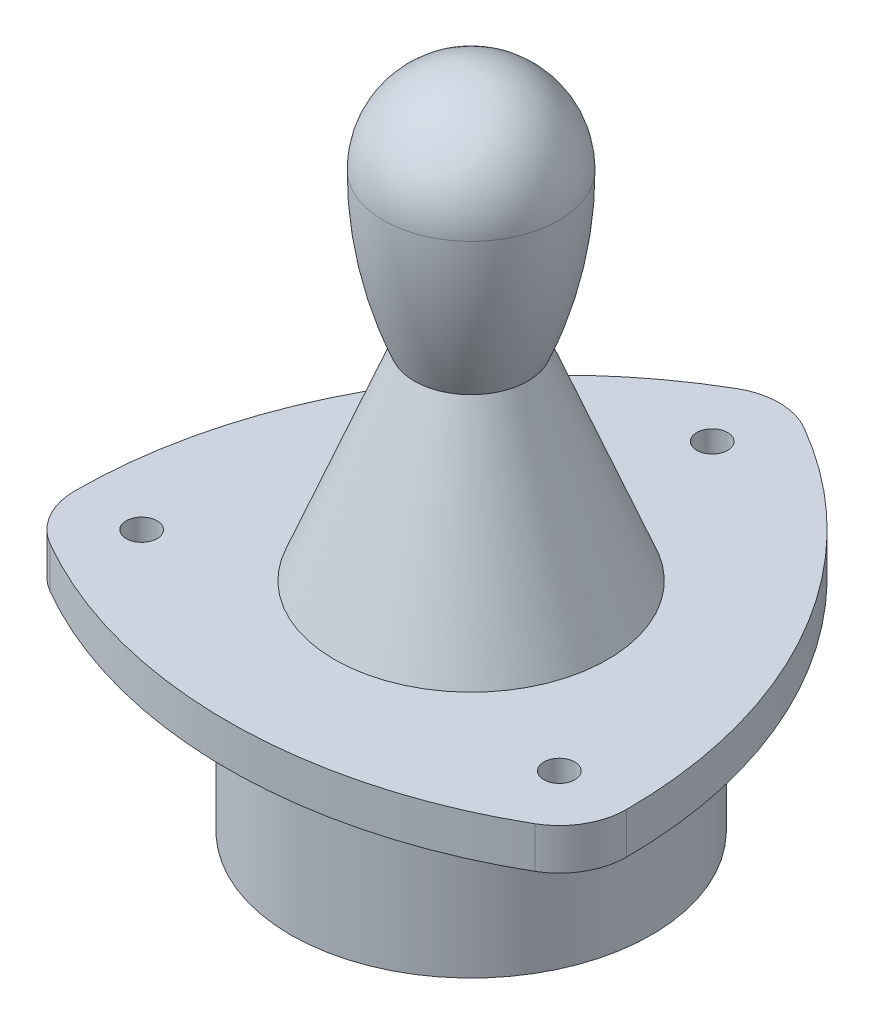
ISO-10303-21;
HEADER;
FILE_DESCRIPTION(('STEP AP214'),'2;1');
FILE_NAME('part.step','',(''),(''),'','','');
FILE_SCHEMA(('AUTOMOTIVE_DESIGN { 1 0 10303 214 1 1 1 1 }'));
ENDSEC;
DATA;
#1=APPLICATION_CONTEXT('core data for automotive mechanical design processes');
#2=APPLICATION_PROTOCOL_DEFINITION('international standard','automotive_design',2000,#1);
#3=PRODUCT_CONTEXT('',#1,'mechanical');
#4=PRODUCT('Part','Part','',(#3));
#5=PRODUCT_RELATED_PRODUCT_CATEGORY('part','',(#4));
#6=PRODUCT_DEFINITION_FORMATION('','',#4);
#7=PRODUCT_DEFINITION_CONTEXT('part definition',#1,'design');
#8=PRODUCT_DEFINITION('design','',#6,#7);
#9=PRODUCT_DEFINITION_SHAPE('','',#8);
#10=(LENGTH_UNIT() NAMED_UNIT(*) SI_UNIT(.MILLI.,.METRE.));
#11=(NAMED_UNIT(*) PLANE_ANGLE_UNIT() SI_UNIT($,.RADIAN.));
#12=(NAMED_UNIT(*) SI_UNIT($,.STERADIAN.) SOLID_ANGLE_UNIT());
#13=UNCERTAINTY_MEASURE_WITH_UNIT(LENGTH_MEASURE(1.E-05),#10,'distance_accuracy_value','');
#14=(GEOMETRIC_REPRESENTATION_CONTEXT(3) GLOBAL_UNCERTAINTY_ASSIGNED_CONTEXT((#13)) GLOBAL_UNIT_ASSIGNED_CONTEXT((#10,
#11,#12)) REPRESENTATION_CONTEXT('',''));
#15=CARTESIAN_POINT('',(0.,0.,0.));
#16=DIRECTION('',(0.,0.,1.));
#17=DIRECTION('',(1.,0.,0.));
#18=AXIS2_PLACEMENT_3D('',#15,#16,#17);
#19=CARTESIAN_POINT('',(0.,42.,0.));
#20=DIRECTION('',(0.,-1.,0.));
#21=DIRECTION('',(0.,0.,-1.));
#22=AXIS2_PLACEMENT_3D('',#19,#20,#21);
#23=CYLINDRICAL_SURFACE('',#22,35.);
#24=CARTESIAN_POINT('',(0.,0.,0.));
#25=DIRECTION('',(0.,1.,0.));
#26=DIRECTION('',(0.,0.,1.));
#27=AXIS2_PLACEMENT_3D('',#24,#25,#26);
#28=CIRCLE('',#27,35.);
#29=CARTESIAN_POINT('',(0.,0.,35.));
#30=VERTEX_POINT('',#29);
#31=EDGE_CURVE('E48',#30,#30,#28,.T.);
#32=ORIENTED_EDGE('',*,*,#31,.T.);
#33=EDGE_LOOP('',(#32));
#34=FACE_BOUND('',#33,.T.);
#35=CARTESIAN_POINT('',(0.,34.,0.));
#36=DIRECTION('',(0.,1.,0.));
#37=DIRECTION('',(0.,0.,1.));
#38=AXIS2_PLACEMENT_3D('',#35,#36,#37);
#39=CIRCLE('',#38,35.);
#40=CARTESIAN_POINT('',(0.,34.,35.));
#41=VERTEX_POINT('',#40);
#42=EDGE_CURVE('E11',#41,#41,#39,.T.);
#43=ORIENTED_EDGE('',*,*,#42,.F.);
#44=EDGE_LOOP('',(#43));
#45=FACE_BOUND('',#44,.T.);
#46=ADVANCED_FACE('F39',(#34,#45),#23,.T.);
#47=CARTESIAN_POINT('',(0.,0.,0.));
#48=DIRECTION('',(0.,1.,0.));
#49=DIRECTION('',(0.,0.,1.));
#50=AXIS2_PLACEMENT_3D('',#47,#48,#49);
#51=PLANE('',#50);
#52=ORIENTED_EDGE('',*,*,#31,.F.);
#53=EDGE_LOOP('',(#52));
#54=FACE_BOUND('',#53,.T.);
#55=ADVANCED_FACE('F171',(#54),#51,.F.);
#56=CARTESIAN_POINT('',(-40.5,34.,23.3826859021798));
#57=DIRECTION('',(0.,1.,0.));
#58=DIRECTION('',(0.,0.,1.));
#59=AXIS2_PLACEMENT_3D('',#56,#57,#58);
#60=CYLINDRICAL_SURFACE('',#59,13.);
#61=CARTESIAN_POINT('',(-40.5,42.,23.3826859021798));
#62=DIRECTION('',(0.,1.,0.));
#63=DIRECTION('',(0.,0.,1.));
#64=AXIS2_PLACEMENT_3D('',#61,#62,#63);
#65=CIRCLE('',#64,13.);
#66=CARTESIAN_POINT('',(-53.5,42.,23.3826859021798));
#67=VERTEX_POINT('',#66);
#68=CARTESIAN_POINT('',(-47.0000000000003,42.,34.6410161513774));
#69=VERTEX_POINT('',#68);
#70=EDGE_CURVE('E132',#67,#69,#65,.T.);
#71=ORIENTED_EDGE('',*,*,#70,.F.);
#72=DIRECTION('',(0.,1.,0.));
#73=VECTOR('',#72,1.);
#74=CARTESIAN_POINT('',(-53.5,34.,23.3826859021798));
#75=LINE('',#74,#73);
#76=CARTESIAN_POINT('',(-53.5,34.,23.3826859021798));
#77=VERTEX_POINT('',#76);
#78=EDGE_CURVE('E56',#77,#67,#75,.T.);
#79=ORIENTED_EDGE('',*,*,#78,.F.);
#80=CARTESIAN_POINT('',(-40.5,34.,23.3826859021798));
#81=DIRECTION('',(0.,1.,0.));
#82=DIRECTION('',(0.,0.,1.));
#83=AXIS2_PLACEMENT_3D('',#80,#81,#82);
#84=CIRCLE('',#83,13.);
#85=CARTESIAN_POINT('',(-47.0000000000003,34.,34.6410161513774));
#86=VERTEX_POINT('',#85);
#87=EDGE_CURVE('E154',#77,#86,#84,.T.);
#88=ORIENTED_EDGE('',*,*,#87,.T.);
#89=DIRECTION('',(0.,1.,0.));
#90=VECTOR('',#89,1.);
#91=CARTESIAN_POINT('',(-47.0000000000003,34.,34.6410161513774));
#92=LINE('',#91,#90);
#93=EDGE_CURVE('E91',#86,#69,#92,.T.);
#94=ORIENTED_EDGE('',*,*,#93,.T.);
#95=EDGE_LOOP('',(#71,#79,#88,#94));
#96=FACE_BOUND('',#95,.T.);
#97=ADVANCED_FACE('F173',(#96),#60,.T.);
#98=CARTESIAN_POINT('',(40.5,34.,23.3826859021798));
#99=DIRECTION('',(0.,1.,0.));
#100=DIRECTION('',(0.,0.,1.));
#101=AXIS2_PLACEMENT_3D('',#98,#99,#100);
#102=CYLINDRICAL_SURFACE('',#101,94.);
#103=CARTESIAN_POINT('',(40.5,42.,23.3826859021798));
#104=DIRECTION('',(0.,1.,0.));
#105=DIRECTION('',(0.,0.,1.));
#106=AXIS2_PLACEMENT_3D('',#103,#104,#105);
#107=CIRCLE('',#106,94.);
#108=CARTESIAN_POINT('',(-6.49999999999999,42.,-58.0237020535574));
#109=VERTEX_POINT('',#108);
#110=EDGE_CURVE('E150',#109,#67,#107,.T.);
#111=ORIENTED_EDGE('',*,*,#110,.F.);
#112=DIRECTION('',(0.,1.,0.));
#113=VECTOR('',#112,1.);
#114=CARTESIAN_POINT('',(-6.49999999999999,34.,-58.0237020535574));
#115=LINE('',#114,#113);
#116=CARTESIAN_POINT('',(-6.49999999999999,34.,-58.0237020535574));
#117=VERTEX_POINT('',#116);
#118=EDGE_CURVE('E79',#117,#109,#115,.T.);
#119=ORIENTED_EDGE('',*,*,#118,.F.);
#120=CARTESIAN_POINT('',(40.5,34.,23.3826859021798));
#121=DIRECTION('',(0.,1.,0.));
#122=DIRECTION('',(0.,0.,1.));
#123=AXIS2_PLACEMENT_3D('',#120,#121,#122);
#124=CIRCLE('',#123,94.);
#125=EDGE_CURVE('E118',#117,#77,#124,.T.);
#126=ORIENTED_EDGE('',*,*,#125,.T.);
#127=ORIENTED_EDGE('',*,*,#78,.T.);
#128=EDGE_LOOP('',(#111,#119,#126,#127));
#129=FACE_BOUND('',#128,.T.);
#130=ADVANCED_FACE('F178',(#129),#102,.T.);
#131=CARTESIAN_POINT('',(0.,34.,-46.7653718043597));
#132=DIRECTION('',(0.,1.,0.));
#133=DIRECTION('',(0.,0.,1.));
#134=AXIS2_PLACEMENT_3D('',#131,#132,#133);
#135=CYLINDRICAL_SURFACE('',#134,12.9999999999999);
#136=CARTESIAN_POINT('',(0.,42.,-46.7653718043597));
#137=DIRECTION('',(0.,1.,0.));
#138=DIRECTION('',(0.,0.,-1.));
#139=AXIS2_PLACEMENT_3D('',#136,#137,#138);
#140=CIRCLE('',#139,12.9999999999999);
#141=CARTESIAN_POINT('',(6.50000000000001,42.,-58.0237020535574));
#142=VERTEX_POINT('',#141);
#143=EDGE_CURVE('E104',#142,#109,#140,.T.);
#144=ORIENTED_EDGE('',*,*,#143,.F.);
#145=DIRECTION('',(0.,1.,0.));
#146=VECTOR('',#145,1.);
#147=CARTESIAN_POINT('',(6.50000000000001,34.,-58.0237020535574));
#148=LINE('',#147,#146);
#149=CARTESIAN_POINT('',(6.50000000000001,34.,-58.0237020535574));
#150=VERTEX_POINT('',#149);
#151=EDGE_CURVE('E99',#150,#142,#148,.T.);
#152=ORIENTED_EDGE('',*,*,#151,.F.);
#153=CARTESIAN_POINT('',(0.,34.,-46.7653718043597));
#154=DIRECTION('',(0.,1.,0.));
#155=DIRECTION('',(0.,0.,-1.));
#156=AXIS2_PLACEMENT_3D('',#153,#154,#155);
#157=CIRCLE('',#156,12.9999999999999);
#158=EDGE_CURVE('E102',#150,#117,#157,.T.);
#159=ORIENTED_EDGE('',*,*,#158,.T.);
#160=ORIENTED_EDGE('',*,*,#118,.T.);
#161=EDGE_LOOP('',(#144,#152,#159,#160));
#162=FACE_BOUND('',#161,.T.);
#163=ADVANCED_FACE('F101',(#162),#135,.T.);
#164=CARTESIAN_POINT('',(-40.5,34.,23.3826859021798));
#165=DIRECTION('',(0.,1.,0.));
#166=DIRECTION('',(0.,0.,1.));
#167=AXIS2_PLACEMENT_3D('',#164,#165,#166);
#168=CYLINDRICAL_SURFACE('',#167,93.9999999999999);
#169=CARTESIAN_POINT('',(-40.5,42.,23.3826859021798));
#170=DIRECTION('',(0.,1.,0.));
#171=DIRECTION('',(0.,0.,1.));
#172=AXIS2_PLACEMENT_3D('',#169,#170,#171);
#173=CIRCLE('',#172,93.9999999999999);
#174=CARTESIAN_POINT('',(53.5,42.,23.3826859021798));
#175=VERTEX_POINT('',#174);
#176=EDGE_CURVE('E145',#175,#142,#173,.T.);
#177=ORIENTED_EDGE('',*,*,#176,.F.);
#178=DIRECTION('',(0.,1.,0.));
#179=VECTOR('',#178,1.);
#180=CARTESIAN_POINT('',(53.5,34.,23.3826859021798));
#181=LINE('',#180,#179);
#182=CARTESIAN_POINT('',(53.5,34.,23.3826859021798));
#183=VERTEX_POINT('',#182);
#184=EDGE_CURVE('E110',#183,#175,#181,.T.);
#185=ORIENTED_EDGE('',*,*,#184,.F.);
#186=CARTESIAN_POINT('',(-40.5,34.,23.3826859021798));
#187=DIRECTION('',(0.,1.,0.));
#188=DIRECTION('',(0.,0.,1.));
#189=AXIS2_PLACEMENT_3D('',#186,#187,#188);
#190=CIRCLE('',#189,93.9999999999999);
#191=EDGE_CURVE('E116',#183,#150,#190,.T.);
#192=ORIENTED_EDGE('',*,*,#191,.T.);
#193=ORIENTED_EDGE('',*,*,#151,.T.);
#194=EDGE_LOOP('',(#177,#185,#192,#193));
#195=FACE_BOUND('',#194,.T.);
#196=ADVANCED_FACE('F121',(#195),#168,.T.);
#197=CARTESIAN_POINT('',(40.5,34.,23.3826859021798));
#198=DIRECTION('',(0.,1.,0.));
#199=DIRECTION('',(0.,0.,1.));
#200=AXIS2_PLACEMENT_3D('',#197,#198,#199);
#201=CYLINDRICAL_SURFACE('',#200,13.);
#202=CARTESIAN_POINT('',(40.5,42.,23.3826859021798));
#203=DIRECTION('',(0.,1.,0.));
#204=DIRECTION('',(0.,0.,-1.));
#205=AXIS2_PLACEMENT_3D('',#202,#203,#204);
#206=CIRCLE('',#205,13.);
#207=CARTESIAN_POINT('',(47.0000000000002,42.,34.6410161513774));
#208=VERTEX_POINT('',#207);
#209=EDGE_CURVE('E141',#208,#175,#206,.T.);
#210=ORIENTED_EDGE('',*,*,#209,.F.);
#211=DIRECTION('',(0.,1.,0.));
#212=VECTOR('',#211,1.);
#213=CARTESIAN_POINT('',(47.0000000000002,34.,34.6410161513774));
#214=LINE('',#213,#212);
#215=CARTESIAN_POINT('',(47.0000000000002,34.,34.6410161513774));
#216=VERTEX_POINT('',#215);
#217=EDGE_CURVE('E161',#216,#208,#214,.T.);
#218=ORIENTED_EDGE('',*,*,#217,.F.);
#219=CARTESIAN_POINT('',(40.5,34.,23.3826859021798));
#220=DIRECTION('',(0.,1.,0.));
#221=DIRECTION('',(0.,0.,-1.));
#222=AXIS2_PLACEMENT_3D('',#219,#220,#221);
#223=CIRCLE('',#222,13.);
#224=EDGE_CURVE('E123',#216,#183,#223,.T.);
#225=ORIENTED_EDGE('',*,*,#224,.T.);
#226=ORIENTED_EDGE('',*,*,#184,.T.);
#227=EDGE_LOOP('',(#210,#218,#225,#226));
#228=FACE_BOUND('',#227,.T.);
#229=ADVANCED_FACE('F190',(#228),#201,.T.);
#230=CARTESIAN_POINT('',(0.,34.,-46.7653718043597));
#231=DIRECTION('',(0.,1.,0.));
#232=DIRECTION('',(0.,0.,1.));
#233=AXIS2_PLACEMENT_3D('',#230,#231,#232);
#234=CYLINDRICAL_SURFACE('',#233,94.);
#235=CARTESIAN_POINT('',(0.,42.,-46.7653718043597));
#236=DIRECTION('',(0.,1.,0.));
#237=DIRECTION('',(0.,0.,1.));
#238=AXIS2_PLACEMENT_3D('',#235,#236,#237);
#239=CIRCLE('',#238,94.);
#240=EDGE_CURVE('E136',#69,#208,#239,.T.);
#241=ORIENTED_EDGE('',*,*,#240,.F.);
#242=ORIENTED_EDGE('',*,*,#93,.F.);
#243=CARTESIAN_POINT('',(0.,34.,-46.7653718043597));
#244=DIRECTION('',(0.,1.,0.));
#245=DIRECTION('',(0.,0.,1.));
#246=AXIS2_PLACEMENT_3D('',#243,#244,#245);
#247=CIRCLE('',#246,94.);
#248=EDGE_CURVE('E126',#86,#216,#247,.T.);
#249=ORIENTED_EDGE('',*,*,#248,.T.);
#250=ORIENTED_EDGE('',*,*,#217,.T.);
#251=EDGE_LOOP('',(#241,#242,#249,#250));
#252=FACE_BOUND('',#251,.T.);
#253=ADVANCED_FACE('F187',(#252),#234,.T.);
#254=CARTESIAN_POINT('',(-20.25,34.,-11.69134295109));
#255=DIRECTION('',(0.,1.,0.));
#256=DIRECTION('',(0.,0.,1.));
#257=AXIS2_PLACEMENT_3D('',#254,#255,#256);
#258=PLANE('',#257);
#259=ORIENTED_EDGE('',*,*,#42,.T.);
#260=EDGE_LOOP('',(#259));
#261=FACE_BOUND('',#260,.T.);
#262=CARTESIAN_POINT('',(40.5,34.,23.3826859021798));
#263=DIRECTION('',(0.,1.,0.));
#264=DIRECTION('',(0.,0.,1.));
#265=AXIS2_PLACEMENT_3D('',#262,#263,#264);
#266=CIRCLE('',#265,3.);
#267=CARTESIAN_POINT('',(40.5,34.,26.3826859021798));
#268=VERTEX_POINT('',#267);
#269=EDGE_CURVE('E243',#268,#268,#266,.T.);
#270=ORIENTED_EDGE('',*,*,#269,.T.);
#271=EDGE_LOOP('',(#270));
#272=FACE_BOUND('',#271,.T.);
#273=CARTESIAN_POINT('',(-40.5,34.,23.3826859021798));
#274=DIRECTION('',(0.,1.,0.));
#275=DIRECTION('',(0.,0.,1.));
#276=AXIS2_PLACEMENT_3D('',#273,#274,#275);
#277=CIRCLE('',#276,2.99999999999998);
#278=CARTESIAN_POINT('',(-40.5,34.,26.3826859021798));
#279=VERTEX_POINT('',#278);
#280=EDGE_CURVE('E251',#279,#279,#277,.T.);
#281=ORIENTED_EDGE('',*,*,#280,.T.);
#282=EDGE_LOOP('',(#281));
#283=FACE_BOUND('',#282,.T.);
#284=CARTESIAN_POINT('',(0.,34.,-46.7653718043597));
#285=DIRECTION('',(0.,1.,0.));
#286=DIRECTION('',(0.,0.,1.));
#287=AXIS2_PLACEMENT_3D('',#284,#285,#286);
#288=CIRCLE('',#287,2.99999999999999);
#289=CARTESIAN_POINT('',(0.,34.,-43.7653718043597));
#290=VERTEX_POINT('',#289);
#291=EDGE_CURVE('E137',#290,#290,#288,.T.);
#292=ORIENTED_EDGE('',*,*,#291,.T.);
#293=EDGE_LOOP('',(#292));
#294=FACE_BOUND('',#293,.T.);
#295=ORIENTED_EDGE('',*,*,#87,.F.);
#296=ORIENTED_EDGE('',*,*,#125,.F.);
#297=ORIENTED_EDGE('',*,*,#158,.F.);
#298=ORIENTED_EDGE('',*,*,#191,.F.);
#299=ORIENTED_EDGE('',*,*,#224,.F.);
#300=ORIENTED_EDGE('',*,*,#248,.F.);
#301=EDGE_LOOP('',(#295,#296,#297,#298,#299,#300));
#302=FACE_BOUND('',#301,.T.);
#303=ADVANCED_FACE('F114',(#261,#272,#283,#294,#302),#258,.F.);
#304=CARTESIAN_POINT('',(0.,34.,-46.7653718043597));
#305=DIRECTION('',(0.,1.,0.));
#306=DIRECTION('',(0.,0.,1.));
#307=AXIS2_PLACEMENT_3D('',#304,#305,#306);
#308=CYLINDRICAL_SURFACE('',#307,2.99999999999999);
#309=ORIENTED_EDGE('',*,*,#291,.F.);
#310=EDGE_LOOP('',(#309));
#311=FACE_BOUND('',#310,.T.);
#312=CARTESIAN_POINT('',(0.,42.,-46.7653718043597));
#313=DIRECTION('',(0.,1.,0.));
#314=DIRECTION('',(0.,0.,1.));
#315=AXIS2_PLACEMENT_3D('',#312,#313,#314);
#316=CIRCLE('',#315,2.99999999999999);
#317=CARTESIAN_POINT('',(0.,42.,-43.7653718043597));
#318=VERTEX_POINT('',#317);
#319=EDGE_CURVE('E255',#318,#318,#316,.T.);
#320=ORIENTED_EDGE('',*,*,#319,.T.);
#321=EDGE_LOOP('',(#320));
#322=FACE_BOUND('',#321,.T.);
#323=ADVANCED_FACE('F202',(#311,#322),#308,.F.);
#324=CARTESIAN_POINT('',(-40.5,34.,23.3826859021798));
#325=DIRECTION('',(0.,1.,0.));
#326=DIRECTION('',(0.,0.,1.));
#327=AXIS2_PLACEMENT_3D('',#324,#325,#326);
#328=CYLINDRICAL_SURFACE('',#327,2.99999999999998);
#329=ORIENTED_EDGE('',*,*,#280,.F.);
#330=EDGE_LOOP('',(#329));
#331=FACE_BOUND('',#330,.T.);
#332=CARTESIAN_POINT('',(-40.5,42.,23.3826859021798));
#333=DIRECTION('',(0.,1.,0.));
#334=DIRECTION('',(0.,0.,1.));
#335=AXIS2_PLACEMENT_3D('',#332,#333,#334);
#336=CIRCLE('',#335,2.99999999999998);
#337=CARTESIAN_POINT('',(-40.5,42.,26.3826859021798));
#338=VERTEX_POINT('',#337);
#339=EDGE_CURVE('E247',#338,#338,#336,.T.);
#340=ORIENTED_EDGE('',*,*,#339,.T.);
#341=EDGE_LOOP('',(#340));
#342=FACE_BOUND('',#341,.T.);
#343=ADVANCED_FACE('F206',(#331,#342),#328,.F.);
#344=CARTESIAN_POINT('',(40.5,34.,23.3826859021798));
#345=DIRECTION('',(0.,1.,0.));
#346=DIRECTION('',(0.,0.,1.));
#347=AXIS2_PLACEMENT_3D('',#344,#345,#346);
#348=CYLINDRICAL_SURFACE('',#347,3.);
#349=ORIENTED_EDGE('',*,*,#269,.F.);
#350=EDGE_LOOP('',(#349));
#351=FACE_BOUND('',#350,.T.);
#352=CARTESIAN_POINT('',(40.5,42.,23.3826859021798));
#353=DIRECTION('',(0.,1.,0.));
#354=DIRECTION('',(0.,0.,1.));
#355=AXIS2_PLACEMENT_3D('',#352,#353,#354);
#356=CIRCLE('',#355,3.);
#357=CARTESIAN_POINT('',(40.5,42.,26.3826859021798));
#358=VERTEX_POINT('',#357);
#359=EDGE_CURVE('E242',#358,#358,#356,.T.);
#360=ORIENTED_EDGE('',*,*,#359,.T.);
#361=EDGE_LOOP('',(#360));
#362=FACE_BOUND('',#361,.T.);
#363=ADVANCED_FACE('F184',(#351,#362),#348,.F.);
#364=CARTESIAN_POINT('',(0.,42.,0.));
#365=DIRECTION('',(0.,1.,0.));
#366=DIRECTION('',(0.,0.,1.));
#367=AXIS2_PLACEMENT_3D('',#364,#365,#366);
#368=PLANE('',#367);
#369=CARTESIAN_POINT('',(0.,42.,0.));
#370=DIRECTION('',(0.,1.,0.));
#371=DIRECTION('',(0.,0.,1.));
#372=AXIS2_PLACEMENT_3D('',#369,#370,#371);
#373=CIRCLE('',#372,26.5);
#374=CARTESIAN_POINT('',(0.,42.,26.5));
#375=VERTEX_POINT('',#374);
#376=EDGE_CURVE('E232',#375,#375,#373,.T.);
#377=ORIENTED_EDGE('',*,*,#376,.F.);
#378=EDGE_LOOP('',(#377));
#379=FACE_BOUND('',#378,.T.);
#380=ORIENTED_EDGE('',*,*,#359,.F.);
#381=EDGE_LOOP('',(#380));
#382=FACE_BOUND('',#381,.T.);
#383=ORIENTED_EDGE('',*,*,#339,.F.);
#384=EDGE_LOOP('',(#383));
#385=FACE_BOUND('',#384,.T.);
#386=ORIENTED_EDGE('',*,*,#319,.F.);
#387=EDGE_LOOP('',(#386));
#388=FACE_BOUND('',#387,.T.);
#389=ORIENTED_EDGE('',*,*,#70,.T.);
#390=ORIENTED_EDGE('',*,*,#240,.T.);
#391=ORIENTED_EDGE('',*,*,#209,.T.);
#392=ORIENTED_EDGE('',*,*,#176,.T.);
#393=ORIENTED_EDGE('',*,*,#143,.T.);
#394=ORIENTED_EDGE('',*,*,#110,.T.);
#395=EDGE_LOOP('',(#389,#390,#391,#392,#393,#394));
#396=FACE_BOUND('',#395,.T.);
#397=ADVANCED_FACE('F181',(#379,#382,#385,#388,#396),#368,.T.);
#398=CARTESIAN_POINT('',(0.,111.,0.));
#399=DIRECTION('',(0.,1.,0.));
#400=DIRECTION('',(0.,0.,-1.));
#401=AXIS2_PLACEMENT_3D('',#398,#399,#400);
#402=SPHERICAL_SURFACE('',#401,17.);
#403=CARTESIAN_POINT('',(0.,111.,0.));
#404=DIRECTION('',(0.,1.,0.));
#405=DIRECTION('',(0.,0.,1.));
#406=AXIS2_PLACEMENT_3D('',#403,#404,#405);
#407=CIRCLE('',#406,17.);
#408=CARTESIAN_POINT('',(0.,111.,17.));
#409=VERTEX_POINT('',#408);
#410=EDGE_CURVE('E236',#409,#409,#407,.T.);
#411=ORIENTED_EDGE('',*,*,#410,.T.);
#412=EDGE_LOOP('',(#411));
#413=FACE_BOUND('',#412,.T.);
#414=ADVANCED_FACE('F183',(#413),#402,.T.);
#415=CARTESIAN_POINT('',(0.,111.,0.));
#416=DIRECTION('',(0.,1.,0.));
#417=DIRECTION('',(0.,0.,1.));
#418=AXIS2_PLACEMENT_3D('',#415,#416,#417);
#419=DEGENERATE_TOROIDAL_SURFACE('',#418,61.,78.,.F.);
#420=ORIENTED_EDGE('',*,*,#410,.F.);
#421=EDGE_LOOP('',(#420));
#422=FACE_BOUND('',#421,.T.);
#423=CARTESIAN_POINT('',(0.,81.,0.));
#424=DIRECTION('',(0.,1.,0.));
#425=DIRECTION('',(0.,0.,1.));
#426=AXIS2_PLACEMENT_3D('',#423,#424,#425);
#427=CIRCLE('',#426,11.);
#428=CARTESIAN_POINT('',(0.,81.,11.));
#429=VERTEX_POINT('',#428);
#430=EDGE_CURVE('E229',#429,#429,#427,.T.);
#431=ORIENTED_EDGE('',*,*,#430,.T.);
#432=EDGE_LOOP('',(#431));
#433=FACE_BOUND('',#432,.T.);
#434=ADVANCED_FACE('F216',(#422,#433),#419,.F.);
#435=CARTESIAN_POINT('',(0.,42.,0.));
#436=DIRECTION('',(0.,-1.,0.));
#437=DIRECTION('',(0.,0.,-1.));
#438=AXIS2_PLACEMENT_3D('',#435,#436,#437);
#439=CONICAL_SURFACE('',#438,26.5,0.37829399134146);
#440=ORIENTED_EDGE('',*,*,#430,.F.);
#441=EDGE_LOOP('',(#440));
#442=FACE_BOUND('',#441,.T.);
#443=ORIENTED_EDGE('',*,*,#376,.T.);
#444=EDGE_LOOP('',(#443));
#445=FACE_BOUND('',#444,.T.);
#446=ADVANCED_FACE('F220',(#442,#445),#439,.T.);
#447=CLOSED_SHELL('',(#46,#55,#97,#130,#163,#196,#229,#253,#303,#323,#343,#363,#397,#414,#434,#446));
#448=MANIFOLD_SOLID_BREP('B2',#447);
#449=ADVANCED_BREP_SHAPE_REPRESENTATION('',(#18,#448),#14);
#450=SHAPE_DEFINITION_REPRESENTATION(#9,#449);
ENDSEC;
END-ISO-10303-21;
